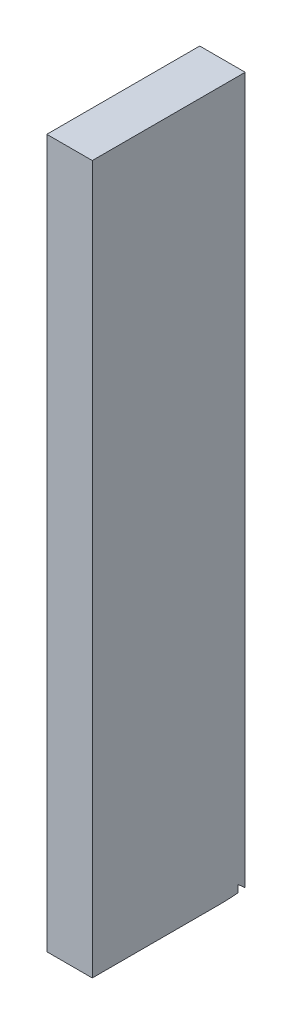
ISO-10303-21;
HEADER;
FILE_DESCRIPTION(('STEP AP214'),'2;1');
FILE_NAME('part.step','',(''),(''),'','','');
FILE_SCHEMA(('AUTOMOTIVE_DESIGN { 1 0 10303 214 1 1 1 1 }'));
ENDSEC;
DATA;
#1=APPLICATION_CONTEXT('core data for automotive mechanical design processes');
#2=APPLICATION_PROTOCOL_DEFINITION('international standard','automotive_design',2000,#1);
#3=PRODUCT_CONTEXT('',#1,'mechanical');
#4=PRODUCT('Part','Part','',(#3));
#5=PRODUCT_RELATED_PRODUCT_CATEGORY('part','',(#4));
#6=PRODUCT_DEFINITION_FORMATION('','',#4);
#7=PRODUCT_DEFINITION_CONTEXT('part definition',#1,'design');
#8=PRODUCT_DEFINITION('design','',#6,#7);
#9=PRODUCT_DEFINITION_SHAPE('','',#8);
#10=(LENGTH_UNIT() NAMED_UNIT(*) SI_UNIT(.MILLI.,.METRE.));
#11=(NAMED_UNIT(*) PLANE_ANGLE_UNIT() SI_UNIT($,.RADIAN.));
#12=(NAMED_UNIT(*) SI_UNIT($,.STERADIAN.) SOLID_ANGLE_UNIT());
#13=UNCERTAINTY_MEASURE_WITH_UNIT(LENGTH_MEASURE(1.E-05),#10,'distance_accuracy_value','');
#14=(GEOMETRIC_REPRESENTATION_CONTEXT(3) GLOBAL_UNCERTAINTY_ASSIGNED_CONTEXT((#13)) GLOBAL_UNIT_ASSIGNED_CONTEXT((#10,
#11,#12)) REPRESENTATION_CONTEXT('',''));
#15=CARTESIAN_POINT('',(0.,0.,0.));
#16=DIRECTION('',(0.,0.,1.));
#17=DIRECTION('',(1.,0.,0.));
#18=AXIS2_PLACEMENT_3D('',#15,#16,#17);
#19=CARTESIAN_POINT('',(130.275545277051,17.2651002409467,47.9190538921824));
#20=DIRECTION('',(1.69244514382854E-09,0.,-1.));
#21=DIRECTION('',(-1.,0.,-1.69244514382854E-09));
#22=AXIS2_PLACEMENT_3D('',#19,#20,#21);
#23=PLANE('',#22);
#24=CARTESIAN_POINT('',(131.258630374064,7.13214472489199,47.9190538938462));
#25=DIRECTION('',(0.,1.,0.));
#26=VECTOR('',#25,1.);
#27=LINE('',#24,#26);
#28=CARTESIAN_POINT('',(131.258630374064,7.13214472489199,47.9190538938462));
#29=VERTEX_POINT('',#28);
#30=CARTESIAN_POINT('',(131.258630374064,7.28593300566058,47.9190538938462));
#31=VERTEX_POINT('',#30);
#32=EDGE_CURVE('E119',#29,#31,#27,.T.);
#33=ORIENTED_EDGE('',*,*,#32,.F.);
#34=CARTESIAN_POINT('',(130.275545277051,7.13214472489199,47.9190538921824));
#35=DIRECTION('',(1.,0.,1.69244241849266E-09));
#36=VECTOR('',#35,1.);
#37=LINE('',#34,#36);
#38=CARTESIAN_POINT('',(130.275545277051,7.13214472489199,47.9190538921824));
#39=VERTEX_POINT('',#38);
#40=EDGE_CURVE('E35',#39,#29,#37,.T.);
#41=ORIENTED_EDGE('',*,*,#40,.F.);
#42=CARTESIAN_POINT('',(130.275545277051,7.13214472489199,47.9190538921824));
#43=DIRECTION('',(0.,1.,0.));
#44=VECTOR('',#43,1.);
#45=LINE('',#42,#44);
#46=CARTESIAN_POINT('',(130.275545277051,7.28593300566058,47.9190538921824));
#47=VERTEX_POINT('',#46);
#48=EDGE_CURVE('E237',#39,#47,#45,.T.);
#49=ORIENTED_EDGE('',*,*,#48,.T.);
#50=CARTESIAN_POINT('',(130.275545277051,7.28593300566058,47.9190538921824));
#51=DIRECTION('',(1.,0.,1.69244241849266E-09));
#52=VECTOR('',#51,1.);
#53=LINE('',#50,#52);
#54=EDGE_CURVE('E10',#47,#31,#53,.T.);
#55=ORIENTED_EDGE('',*,*,#54,.T.);
#56=EDGE_LOOP('',(#33,#41,#49,#55));
#57=FACE_BOUND('',#56,.T.);
#58=ADVANCED_FACE('F16',(#57),#23,.T.);
#59=CARTESIAN_POINT('',(130.275545277051,7.28593300566058,47.9190538921824));
#60=DIRECTION('',(-1.13344283386829E-09,-0.742625180746559,0.669707280026984));
#61=DIRECTION('',(0.,-0.669707280026984,-0.742625180746559));
#62=AXIS2_PLACEMENT_3D('',#59,#60,#61);
#63=PLANE('',#62);
#64=DIRECTION('',(1.2566299085729E-09,-0.669707280026984,-0.742625180746559));
#65=VECTOR('',#64,1.);
#66=CARTESIAN_POINT('',(131.258630374064,7.28593300566058,47.9190538938462));
#67=LINE('',#66,#65);
#68=CARTESIAN_POINT('',(131.258630374323,7.14798250609013,47.7660833084384));
#69=VERTEX_POINT('',#68);
#70=EDGE_CURVE('E144',#31,#69,#67,.T.);
#71=ORIENTED_EDGE('',*,*,#70,.F.);
#72=ORIENTED_EDGE('',*,*,#54,.F.);
#73=DIRECTION('',(1.2566299085729E-09,-0.669707280026984,-0.742625180746559));
#74=VECTOR('',#73,1.);
#75=CARTESIAN_POINT('',(130.275545277051,7.28593300566058,47.9190538921824));
#76=LINE('',#75,#74);
#77=CARTESIAN_POINT('',(130.27554527731,7.14798250609013,47.7660833067746));
#78=VERTEX_POINT('',#77);
#79=EDGE_CURVE('E315',#47,#78,#76,.T.);
#80=ORIENTED_EDGE('',*,*,#79,.T.);
#81=DIRECTION('',(1.,0.,1.69244514382854E-09));
#82=VECTOR('',#81,1.);
#83=CARTESIAN_POINT('',(130.27554527731,7.14798250609013,47.7660833067746));
#84=LINE('',#83,#82);
#85=EDGE_CURVE('E27',#78,#69,#84,.T.);
#86=ORIENTED_EDGE('',*,*,#85,.T.);
#87=EDGE_LOOP('',(#71,#72,#80,#86));
#88=FACE_BOUND('',#87,.T.);
#89=ADVANCED_FACE('F213',(#88),#63,.T.);
#90=CARTESIAN_POINT('',(130.27554527731,7.14798250609013,47.7660833067746));
#91=DIRECTION('',(1.69244514382854E-09,0.,-1.));
#92=DIRECTION('',(-1.,0.,-1.69244514382854E-09));
#93=AXIS2_PLACEMENT_3D('',#90,#91,#92);
#94=PLANE('',#93);
#95=DIRECTION('',(0.,1.,0.));
#96=VECTOR('',#95,1.);
#97=CARTESIAN_POINT('',(131.258630374323,7.14798250609013,47.7660833084384));
#98=LINE('',#97,#96);
#99=CARTESIAN_POINT('',(131.258630374323,22.4180708263544,47.7660833084384));
#100=VERTEX_POINT('',#99);
#101=EDGE_CURVE('E151',#69,#100,#98,.T.);
#102=ORIENTED_EDGE('',*,*,#101,.F.);
#103=ORIENTED_EDGE('',*,*,#85,.F.);
#104=DIRECTION('',(0.,1.,0.));
#105=VECTOR('',#104,1.);
#106=CARTESIAN_POINT('',(130.27554527731,7.14798250609013,47.7660833067746));
#107=LINE('',#106,#105);
#108=CARTESIAN_POINT('',(130.27554527731,22.4180708263544,47.7660833067746));
#109=VERTEX_POINT('',#108);
#110=EDGE_CURVE('E314',#78,#109,#107,.T.);
#111=ORIENTED_EDGE('',*,*,#110,.T.);
#112=DIRECTION('',(1.,0.,1.69244514382854E-09));
#113=VECTOR('',#112,1.);
#114=CARTESIAN_POINT('',(130.27554527731,22.4180708263544,47.7660833067746));
#115=LINE('',#114,#113);
#116=EDGE_CURVE('E172',#109,#100,#115,.T.);
#117=ORIENTED_EDGE('',*,*,#116,.T.);
#118=EDGE_LOOP('',(#102,#103,#111,#117));
#119=FACE_BOUND('',#118,.T.);
#120=ADVANCED_FACE('F210',(#119),#94,.T.);
#121=CARTESIAN_POINT('',(130.27554527731,22.4180708263544,47.7660833067746));
#122=DIRECTION('',(0.,1.,0.));
#123=DIRECTION('',(-1.,0.,0.));
#124=AXIS2_PLACEMENT_3D('',#121,#122,#123);
#125=PLANE('',#124);
#126=DIRECTION('',(-1.69244514382854E-09,0.,1.));
#127=VECTOR('',#126,1.);
#128=CARTESIAN_POINT('',(131.258630374323,22.4180708263544,47.7660833084384));
#129=LINE('',#128,#127);
#130=CARTESIAN_POINT('',(131.258630368727,22.4180708263527,51.072024479254));
#131=VERTEX_POINT('',#130);
#132=EDGE_CURVE('E156',#100,#131,#129,.T.);
#133=ORIENTED_EDGE('',*,*,#132,.F.);
#134=ORIENTED_EDGE('',*,*,#116,.F.);
#135=DIRECTION('',(-1.69244514382854E-09,0.,1.));
#136=VECTOR('',#135,1.);
#137=CARTESIAN_POINT('',(130.27554527731,22.4180708263544,47.7660833067746));
#138=LINE('',#137,#136);
#139=CARTESIAN_POINT('',(130.275545271714,22.4180708263527,51.0720244775901));
#140=VERTEX_POINT('',#139);
#141=EDGE_CURVE('E104',#109,#140,#138,.T.);
#142=ORIENTED_EDGE('',*,*,#141,.T.);
#143=DIRECTION('',(1.,0.,1.69244514382854E-09));
#144=VECTOR('',#143,1.);
#145=CARTESIAN_POINT('',(130.275545271714,22.4180708263527,51.0720244775901));
#146=LINE('',#145,#144);
#147=EDGE_CURVE('E96',#140,#131,#146,.T.);
#148=ORIENTED_EDGE('',*,*,#147,.T.);
#149=EDGE_LOOP('',(#133,#134,#142,#148));
#150=FACE_BOUND('',#149,.T.);
#151=ADVANCED_FACE('F207',(#150),#125,.T.);
#152=CARTESIAN_POINT('',(130.275545271714,22.4180708263527,51.0720244775901));
#153=DIRECTION('',(-1.69244514382854E-09,0.,1.));
#154=DIRECTION('',(1.,0.,1.69244514382854E-09));
#155=AXIS2_PLACEMENT_3D('',#152,#153,#154);
#156=PLANE('',#155);
#157=DIRECTION('',(0.,-1.,0.));
#158=VECTOR('',#157,1.);
#159=CARTESIAN_POINT('',(131.258630368727,22.4180708263527,51.072024479254));
#160=LINE('',#159,#158);
#161=CARTESIAN_POINT('',(131.258630368727,7.11212965553896,51.0720244750245));
#162=VERTEX_POINT('',#161);
#163=EDGE_CURVE('E159',#131,#162,#160,.T.);
#164=ORIENTED_EDGE('',*,*,#163,.F.);
#165=ORIENTED_EDGE('',*,*,#147,.F.);
#166=DIRECTION('',(0.,-1.,0.));
#167=VECTOR('',#166,1.);
#168=CARTESIAN_POINT('',(130.275545271714,22.4180708263527,51.0720244775901));
#169=LINE('',#168,#167);
#170=CARTESIAN_POINT('',(130.275545271714,7.11212965553896,51.0720244733607));
#171=VERTEX_POINT('',#170);
#172=EDGE_CURVE('E99',#140,#171,#169,.T.);
#173=ORIENTED_EDGE('',*,*,#172,.T.);
#174=DIRECTION('',(1.,0.,1.69244514382854E-09));
#175=VECTOR('',#174,1.);
#176=CARTESIAN_POINT('',(130.275545271714,7.11212965553896,51.0720244733607));
#177=LINE('',#176,#175);
#178=EDGE_CURVE('E85',#171,#162,#177,.T.);
#179=ORIENTED_EDGE('',*,*,#178,.T.);
#180=EDGE_LOOP('',(#164,#165,#173,#179));
#181=FACE_BOUND('',#180,.T.);
#182=ADVANCED_FACE('F100',(#181),#156,.T.);
#183=CARTESIAN_POINT('',(130.275545271714,7.11212965553896,51.0720244733607));
#184=DIRECTION('',(0.,-1.,0.));
#185=DIRECTION('',(0.,0.,-1.));
#186=AXIS2_PLACEMENT_3D('',#183,#184,#185);
#187=PLANE('',#186);
#188=DIRECTION('',(1.69244514382854E-09,0.,-1.));
#189=VECTOR('',#188,1.);
#190=CARTESIAN_POINT('',(131.258630368727,7.11212965553896,51.0720244750245));
#191=LINE('',#190,#189);
#192=CARTESIAN_POINT('',(131.258630373381,7.11218489307596,48.3225648710807));
#193=VERTEX_POINT('',#192);
#194=EDGE_CURVE('E92',#162,#193,#191,.T.);
#195=ORIENTED_EDGE('',*,*,#194,.F.);
#196=ORIENTED_EDGE('',*,*,#178,.F.);
#197=DIRECTION('',(1.69244514382854E-09,0.,-1.));
#198=VECTOR('',#197,1.);
#199=CARTESIAN_POINT('',(130.275545271714,7.11212965553896,51.0720244733607));
#200=LINE('',#199,#198);
#201=CARTESIAN_POINT('',(130.275545276368,7.11218489307596,48.3225648694169));
#202=VERTEX_POINT('',#201);
#203=EDGE_CURVE('E89',#171,#202,#200,.T.);
#204=ORIENTED_EDGE('',*,*,#203,.T.);
#205=CARTESIAN_POINT('',(131.258630373381,7.11218489307596,48.3225648710807));
#206=DIRECTION('',(-1.,0.,-1.69244241849266E-09));
#207=VECTOR('',#206,1.);
#208=LINE('',#205,#207);
#209=EDGE_CURVE('E61',#202,#193,#208,.F.);
#210=ORIENTED_EDGE('',*,*,#209,.T.);
#211=EDGE_LOOP('',(#195,#196,#204,#210));
#212=FACE_BOUND('',#211,.T.);
#213=ADVANCED_FACE('F87',(#212),#187,.T.);
#214=CARTESIAN_POINT('',(130.275545276368,7.11218489307596,48.3225648694169));
#215=CARTESIAN_POINT('',(130.275545276419,7.11231277307858,48.2922939020098));
#216=CARTESIAN_POINT('',(130.275545276529,7.11270986375952,48.2272128879799));
#217=CARTESIAN_POINT('',(130.275545276698,7.11639702398645,48.1273763262875));
#218=CARTESIAN_POINT('',(130.275545276875,7.12255184043212,48.0230911199284));
#219=CARTESIAN_POINT('',(130.275545276992,7.12894646925565,47.9537397733081));
#220=CARTESIAN_POINT('',(130.275545277051,7.13214472489199,47.9190538921824));
#221=B_SPLINE_CURVE_WITH_KNOTS('',3,(#214,#215,#216,#217,#218,#219,#220),.UNSPECIFIED.,.F.,.F.,
(4,1,1,1,4),(0.0327527620016734,0.250076134729239,0.500002540401837,0.749927675640898,1.),.UNSPECIFIED.);
#222=DIRECTION('',(1.,0.,1.69244514382854E-09));
#223=VECTOR('',#222,1.);
#224=SURFACE_OF_LINEAR_EXTRUSION('',#221,#223);
#225=CARTESIAN_POINT('',(131.258630374064,7.13214472489199,47.9190538938462));
#226=CARTESIAN_POINT('',(131.258630374005,7.12894646925565,47.9537397749719));
#227=CARTESIAN_POINT('',(131.258630373888,7.12255184043212,48.0230911215922));
#228=CARTESIAN_POINT('',(131.258630373711,7.11639702398645,48.1273763279514));
#229=CARTESIAN_POINT('',(131.258630373542,7.11270986375952,48.2272128896437));
#230=CARTESIAN_POINT('',(131.258630373432,7.11231277307858,48.2922939036736));
#231=CARTESIAN_POINT('',(131.258630373381,7.11218489307596,48.3225648710807));
#232=B_SPLINE_CURVE_WITH_KNOTS('',3,(#225,#226,#227,#228,#229,#230,#231),.UNSPECIFIED.,.F.,.F.,
(4,1,1,1,4),(0.0327527620016734,0.282825086360776,0.532750221599836,0.782676627272434,1.),.UNSPECIFIED.);
#233=EDGE_CURVE('E162',#193,#29,#232,.F.);
#234=ORIENTED_EDGE('',*,*,#233,.F.);
#235=ORIENTED_EDGE('',*,*,#209,.F.);
#236=CARTESIAN_POINT('',(130.275545276368,7.11218489307596,48.3225648694169));
#237=CARTESIAN_POINT('',(130.275545276419,7.11231277307858,48.2922939020098));
#238=CARTESIAN_POINT('',(130.275545276529,7.11270986375952,48.2272128879799));
#239=CARTESIAN_POINT('',(130.275545276698,7.11639702398645,48.1273763262875));
#240=CARTESIAN_POINT('',(130.275545276875,7.12255184043212,48.0230911199284));
#241=CARTESIAN_POINT('',(130.275545276992,7.12894646925565,47.9537397733081));
#242=CARTESIAN_POINT('',(130.275545277051,7.13214472489199,47.9190538921824));
#243=B_SPLINE_CURVE_WITH_KNOTS('',3,(#236,#237,#238,#239,#240,#241,#242),.UNSPECIFIED.,.F.,.F.,
(4,1,1,1,4),(0.0327527620016734,0.250076134729239,0.500002540401837,0.749927675640898,1.),.UNSPECIFIED.);
#244=EDGE_CURVE('E108',#202,#39,#243,.T.);
#245=ORIENTED_EDGE('',*,*,#244,.T.);
#246=ORIENTED_EDGE('',*,*,#40,.T.);
#247=EDGE_LOOP('',(#234,#235,#245,#246));
#248=FACE_BOUND('',#247,.T.);
#249=ADVANCED_FACE('F136',(#248),#224,.T.);
#250=CARTESIAN_POINT('',(130.275545201028,17.2651002409467,92.8378607087388));
#251=DIRECTION('',(1.,0.,1.69244514382854E-09));
#252=DIRECTION('',(0.,1.,0.));
#253=AXIS2_PLACEMENT_3D('',#250,#251,#252);
#254=PLANE('',#253);
#255=ORIENTED_EDGE('',*,*,#48,.F.);
#256=ORIENTED_EDGE('',*,*,#244,.F.);
#257=ORIENTED_EDGE('',*,*,#203,.F.);
#258=ORIENTED_EDGE('',*,*,#172,.F.);
#259=ORIENTED_EDGE('',*,*,#141,.F.);
#260=ORIENTED_EDGE('',*,*,#110,.F.);
#261=ORIENTED_EDGE('',*,*,#79,.F.);
#262=EDGE_LOOP('',(#255,#256,#257,#258,#259,#260,#261));
#263=FACE_BOUND('',#262,.T.);
#264=ADVANCED_FACE('F107',(#263),#254,.F.);
#265=CARTESIAN_POINT('',(131.258630298041,17.2651002409467,92.8378607104026));
#266=DIRECTION('',(1.,0.,1.69244514382854E-09));
#267=DIRECTION('',(0.,1.,0.));
#268=AXIS2_PLACEMENT_3D('',#265,#266,#267);
#269=PLANE('',#268);
#270=ORIENTED_EDGE('',*,*,#32,.T.);
#271=ORIENTED_EDGE('',*,*,#70,.T.);
#272=ORIENTED_EDGE('',*,*,#101,.T.);
#273=ORIENTED_EDGE('',*,*,#132,.T.);
#274=ORIENTED_EDGE('',*,*,#163,.T.);
#275=ORIENTED_EDGE('',*,*,#194,.T.);
#276=ORIENTED_EDGE('',*,*,#233,.T.);
#277=EDGE_LOOP('',(#270,#271,#272,#273,#274,#275,#276));
#278=FACE_BOUND('',#277,.T.);
#279=ADVANCED_FACE('F125',(#278),#269,.T.);
#280=CLOSED_SHELL('',(#58,#89,#120,#151,#182,#213,#249,#264,#279));
#281=MANIFOLD_SOLID_BREP('B1',#280);
#282=ADVANCED_BREP_SHAPE_REPRESENTATION('',(#18,#281),#14);
#283=SHAPE_DEFINITION_REPRESENTATION(#9,#282);
ENDSEC;
END-ISO-10303-21;
